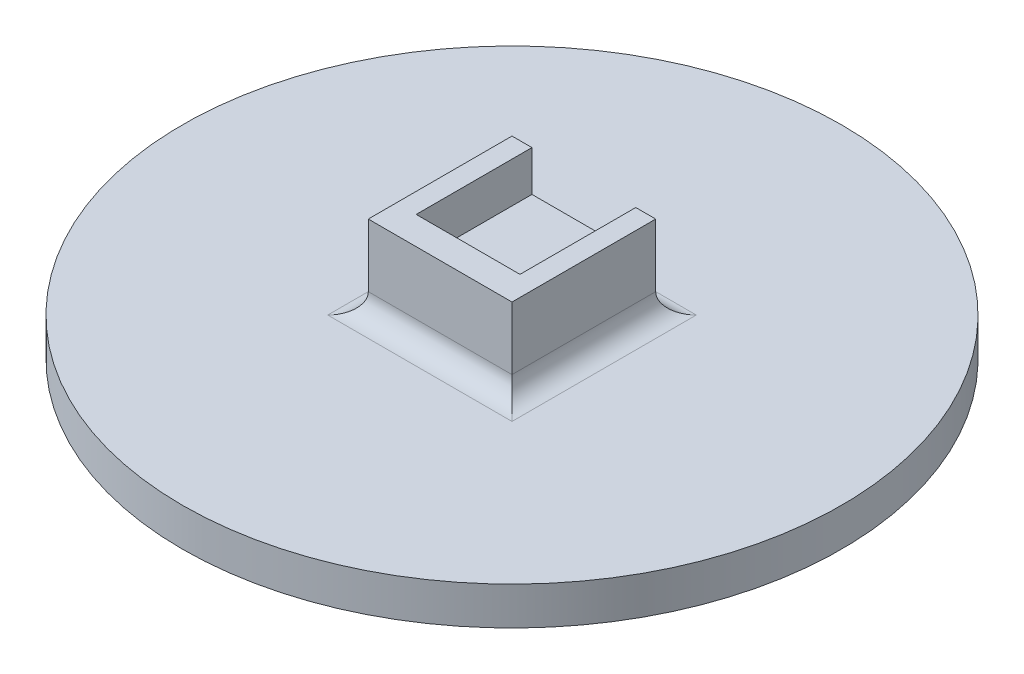
ISO-10303-21;
HEADER;
FILE_DESCRIPTION(('STEP AP214'),'2;1');
FILE_NAME('part.step','',(''),(''),'','','');
FILE_SCHEMA(('AUTOMOTIVE_DESIGN { 1 0 10303 214 1 1 1 1 }'));
ENDSEC;
DATA;
#1=APPLICATION_CONTEXT('core data for automotive mechanical design processes');
#2=APPLICATION_PROTOCOL_DEFINITION('international standard','automotive_design',2000,#1);
#3=PRODUCT_CONTEXT('',#1,'mechanical');
#4=PRODUCT('Part','Part','',(#3));
#5=PRODUCT_RELATED_PRODUCT_CATEGORY('part','',(#4));
#6=PRODUCT_DEFINITION_FORMATION('','',#4);
#7=PRODUCT_DEFINITION_CONTEXT('part definition',#1,'design');
#8=PRODUCT_DEFINITION('design','',#6,#7);
#9=PRODUCT_DEFINITION_SHAPE('','',#8);
#10=(LENGTH_UNIT() NAMED_UNIT(*) SI_UNIT(.MILLI.,.METRE.));
#11=(NAMED_UNIT(*) PLANE_ANGLE_UNIT() SI_UNIT($,.RADIAN.));
#12=(NAMED_UNIT(*) SI_UNIT($,.STERADIAN.) SOLID_ANGLE_UNIT());
#13=UNCERTAINTY_MEASURE_WITH_UNIT(LENGTH_MEASURE(1.E-05),#10,'distance_accuracy_value','');
#14=(GEOMETRIC_REPRESENTATION_CONTEXT(3) GLOBAL_UNCERTAINTY_ASSIGNED_CONTEXT((#13)) GLOBAL_UNIT_ASSIGNED_CONTEXT((#10,
#11,#12)) REPRESENTATION_CONTEXT('',''));
#15=CARTESIAN_POINT('',(0.,0.,0.));
#16=DIRECTION('',(0.,0.,1.));
#17=DIRECTION('',(1.,0.,0.));
#18=AXIS2_PLACEMENT_3D('',#15,#16,#17);
#19=CARTESIAN_POINT('',(0.,10.0965,0.));
#20=DIRECTION('',(0.,-1.,0.));
#21=DIRECTION('',(0.,0.,-1.));
#22=AXIS2_PLACEMENT_3D('',#19,#20,#21);
#23=PLANE('',#22);
#24=DIRECTION('',(0.,0.,-1.));
#25=VECTOR('',#24,1.);
#26=CARTESIAN_POINT('',(-6.5,10.0965,-9.));
#27=LINE('',#26,#25);
#28=CARTESIAN_POINT('',(-6.5,10.0965,5.5));
#29=VERTEX_POINT('',#28);
#30=CARTESIAN_POINT('',(-6.5,10.0965,-9.));
#31=VERTEX_POINT('',#30);
#32=EDGE_CURVE('E51',#29,#31,#27,.T.);
#33=ORIENTED_EDGE('',*,*,#32,.F.);
#34=DIRECTION('',(-1.,0.,0.));
#35=VECTOR('',#34,1.);
#36=CARTESIAN_POINT('',(-6.5,10.0965,5.5));
#37=LINE('',#36,#35);
#38=CARTESIAN_POINT('',(6.5,10.0965,5.5));
#39=VERTEX_POINT('',#38);
#40=EDGE_CURVE('E136',#39,#29,#37,.T.);
#41=ORIENTED_EDGE('',*,*,#40,.F.);
#42=DIRECTION('',(0.,0.,1.));
#43=VECTOR('',#42,1.);
#44=CARTESIAN_POINT('',(6.5,10.0965,5.5));
#45=LINE('',#44,#43);
#46=CARTESIAN_POINT('',(6.5,10.0965,-9.));
#47=VERTEX_POINT('',#46);
#48=EDGE_CURVE('E150',#47,#39,#45,.T.);
#49=ORIENTED_EDGE('',*,*,#48,.F.);
#50=DIRECTION('',(-1.,0.,0.));
#51=VECTOR('',#50,1.);
#52=CARTESIAN_POINT('',(-9.,10.0965,-9.));
#53=LINE('',#52,#51);
#54=EDGE_CURVE('E56',#47,#31,#53,.T.);
#55=ORIENTED_EDGE('',*,*,#54,.T.);
#56=EDGE_LOOP('',(#33,#41,#49,#55));
#57=FACE_BOUND('',#56,.T.);
#58=ADVANCED_FACE('F34',(#57),#23,.F.);
#59=CARTESIAN_POINT('',(0.,4.7625,0.));
#60=DIRECTION('',(0.,-1.,0.));
#61=DIRECTION('',(0.,0.,-1.));
#62=AXIS2_PLACEMENT_3D('',#59,#60,#61);
#63=CYLINDRICAL_SURFACE('',#62,41.275);
#64=CARTESIAN_POINT('',(0.,4.7625,0.));
#65=DIRECTION('',(0.,1.,0.));
#66=DIRECTION('',(0.,0.,1.));
#67=AXIS2_PLACEMENT_3D('',#64,#65,#66);
#68=CIRCLE('',#67,41.275);
#69=CARTESIAN_POINT('',(0.,4.7625,41.275));
#70=VERTEX_POINT('',#69);
#71=EDGE_CURVE('E173',#70,#70,#68,.T.);
#72=ORIENTED_EDGE('',*,*,#71,.F.);
#73=EDGE_LOOP('',(#72));
#74=FACE_BOUND('',#73,.T.);
#75=CARTESIAN_POINT('',(0.,0.,0.));
#76=DIRECTION('',(0.,1.,0.));
#77=DIRECTION('',(0.,0.,1.));
#78=AXIS2_PLACEMENT_3D('',#75,#76,#77);
#79=CIRCLE('',#78,41.275);
#80=CARTESIAN_POINT('',(0.,0.,41.275));
#81=VERTEX_POINT('',#80);
#82=EDGE_CURVE('E172',#81,#81,#79,.T.);
#83=ORIENTED_EDGE('',*,*,#82,.T.);
#84=EDGE_LOOP('',(#83));
#85=FACE_BOUND('',#84,.T.);
#86=ADVANCED_FACE('F245',(#74,#85),#63,.T.);
#87=CARTESIAN_POINT('',(0.,4.7625,0.));
#88=DIRECTION('',(0.,1.,0.));
#89=DIRECTION('',(0.,0.,1.));
#90=AXIS2_PLACEMENT_3D('',#87,#88,#89);
#91=PLANE('',#90);
#92=DIRECTION('',(-1.,0.,0.));
#93=VECTOR('',#92,1.);
#94=CARTESIAN_POINT('',(0.,4.7625,-11.54));
#95=LINE('',#94,#93);
#96=CARTESIAN_POINT('',(-11.54,4.7625,-11.54));
#97=VERTEX_POINT('',#96);
#98=CARTESIAN_POINT('',(11.54,4.7625,-11.54));
#99=VERTEX_POINT('',#98);
#100=EDGE_CURVE('E185',#97,#99,#95,.F.);
#101=ORIENTED_EDGE('',*,*,#100,.T.);
#102=DIRECTION('',(0.,0.,-1.));
#103=VECTOR('',#102,1.);
#104=CARTESIAN_POINT('',(11.54,4.7625,0.));
#105=LINE('',#104,#103);
#106=CARTESIAN_POINT('',(11.54,4.7625,11.54));
#107=VERTEX_POINT('',#106);
#108=EDGE_CURVE('E187',#99,#107,#105,.F.);
#109=ORIENTED_EDGE('',*,*,#108,.T.);
#110=DIRECTION('',(1.,0.,0.));
#111=VECTOR('',#110,1.);
#112=CARTESIAN_POINT('',(0.,4.7625,11.54));
#113=LINE('',#112,#111);
#114=CARTESIAN_POINT('',(-11.54,4.7625,11.54));
#115=VERTEX_POINT('',#114);
#116=EDGE_CURVE('E181',#107,#115,#113,.F.);
#117=ORIENTED_EDGE('',*,*,#116,.T.);
#118=DIRECTION('',(0.,0.,1.));
#119=VECTOR('',#118,1.);
#120=CARTESIAN_POINT('',(-11.54,4.7625,0.));
#121=LINE('',#120,#119);
#122=EDGE_CURVE('E183',#115,#97,#121,.F.);
#123=ORIENTED_EDGE('',*,*,#122,.T.);
#124=EDGE_LOOP('',(#101,#109,#117,#123));
#125=FACE_BOUND('',#124,.T.);
#126=ORIENTED_EDGE('',*,*,#71,.T.);
#127=EDGE_LOOP('',(#126));
#128=FACE_BOUND('',#127,.T.);
#129=ADVANCED_FACE('F210',(#125,#128),#91,.T.);
#130=CARTESIAN_POINT('',(0.,0.,0.));
#131=DIRECTION('',(0.,1.,0.));
#132=DIRECTION('',(0.,0.,1.));
#133=AXIS2_PLACEMENT_3D('',#130,#131,#132);
#134=PLANE('',#133);
#135=ORIENTED_EDGE('',*,*,#82,.F.);
#136=EDGE_LOOP('',(#135));
#137=FACE_BOUND('',#136,.T.);
#138=ADVANCED_FACE('F262',(#137),#134,.F.);
#139=CARTESIAN_POINT('',(9.,10.0965,9.));
#140=DIRECTION('',(-1.,0.,0.));
#141=DIRECTION('',(0.,0.,1.));
#142=AXIS2_PLACEMENT_3D('',#139,#140,#141);
#143=PLANE('',#142);
#144=DIRECTION('',(0.,-1.,0.));
#145=VECTOR('',#144,1.);
#146=CARTESIAN_POINT('',(9.,10.0965,9.));
#147=LINE('',#146,#145);
#148=CARTESIAN_POINT('',(9.,15.1765,9.));
#149=VERTEX_POINT('',#148);
#150=CARTESIAN_POINT('',(9.,7.3025,9.));
#151=VERTEX_POINT('',#150);
#152=EDGE_CURVE('E120',#149,#151,#147,.T.);
#153=ORIENTED_EDGE('',*,*,#152,.T.);
#154=DIRECTION('',(0.,0.,-1.));
#155=VECTOR('',#154,1.);
#156=CARTESIAN_POINT('',(9.,7.3025,9.));
#157=LINE('',#156,#155);
#158=CARTESIAN_POINT('',(9.,7.3025,-9.));
#159=VERTEX_POINT('',#158);
#160=EDGE_CURVE('E176',#151,#159,#157,.T.);
#161=ORIENTED_EDGE('',*,*,#160,.T.);
#162=DIRECTION('',(0.,-1.,0.));
#163=VECTOR('',#162,1.);
#164=CARTESIAN_POINT('',(9.,10.0965,-9.));
#165=LINE('',#164,#163);
#166=CARTESIAN_POINT('',(9.,15.1765,-9.));
#167=VERTEX_POINT('',#166);
#168=EDGE_CURVE('E169',#167,#159,#165,.T.);
#169=ORIENTED_EDGE('',*,*,#168,.F.);
#170=DIRECTION('',(0.,0.,-1.));
#171=VECTOR('',#170,1.);
#172=CARTESIAN_POINT('',(9.,15.1765,9.));
#173=LINE('',#172,#171);
#174=EDGE_CURVE('E129',#149,#167,#173,.T.);
#175=ORIENTED_EDGE('',*,*,#174,.F.);
#176=EDGE_LOOP('',(#153,#161,#169,#175));
#177=FACE_BOUND('',#176,.T.);
#178=ADVANCED_FACE('F220',(#177),#143,.F.);
#179=CARTESIAN_POINT('',(-9.,10.0965,-9.));
#180=DIRECTION('',(0.,0.,1.));
#181=DIRECTION('',(1.,0.,0.));
#182=AXIS2_PLACEMENT_3D('',#179,#180,#181);
#183=PLANE('',#182);
#184=ORIENTED_EDGE('',*,*,#168,.T.);
#185=DIRECTION('',(-1.,0.,0.));
#186=VECTOR('',#185,1.);
#187=CARTESIAN_POINT('',(-9.,7.3025,-9.));
#188=LINE('',#187,#186);
#189=CARTESIAN_POINT('',(-9.,7.3025,-9.));
#190=VERTEX_POINT('',#189);
#191=EDGE_CURVE('E190',#159,#190,#188,.T.);
#192=ORIENTED_EDGE('',*,*,#191,.T.);
#193=DIRECTION('',(0.,-1.,0.));
#194=VECTOR('',#193,1.);
#195=CARTESIAN_POINT('',(-9.,10.0965,-9.));
#196=LINE('',#195,#194);
#197=CARTESIAN_POINT('',(-9.,15.1765,-9.));
#198=VERTEX_POINT('',#197);
#199=EDGE_CURVE('E119',#198,#190,#196,.T.);
#200=ORIENTED_EDGE('',*,*,#199,.F.);
#201=DIRECTION('',(-1.,0.,0.));
#202=VECTOR('',#201,1.);
#203=CARTESIAN_POINT('',(-9.,15.1765,-9.));
#204=LINE('',#203,#202);
#205=CARTESIAN_POINT('',(-6.5,15.1765,-9.));
#206=VERTEX_POINT('',#205);
#207=EDGE_CURVE('E134',#206,#198,#204,.T.);
#208=ORIENTED_EDGE('',*,*,#207,.F.);
#209=DIRECTION('',(0.,-1.,0.));
#210=VECTOR('',#209,1.);
#211=CARTESIAN_POINT('',(-6.5,15.1765,-9.));
#212=LINE('',#211,#210);
#213=EDGE_CURVE('E149',#206,#31,#212,.T.);
#214=ORIENTED_EDGE('',*,*,#213,.T.);
#215=ORIENTED_EDGE('',*,*,#54,.F.);
#216=DIRECTION('',(0.,-1.,0.));
#217=VECTOR('',#216,1.);
#218=CARTESIAN_POINT('',(6.5,15.1765,-9.));
#219=LINE('',#218,#217);
#220=CARTESIAN_POINT('',(6.5,15.1765,-9.));
#221=VERTEX_POINT('',#220);
#222=EDGE_CURVE('E162',#221,#47,#219,.T.);
#223=ORIENTED_EDGE('',*,*,#222,.F.);
#224=DIRECTION('',(-1.,0.,0.));
#225=VECTOR('',#224,1.);
#226=CARTESIAN_POINT('',(6.5,15.1765,-9.));
#227=LINE('',#226,#225);
#228=EDGE_CURVE('E140',#167,#221,#227,.T.);
#229=ORIENTED_EDGE('',*,*,#228,.F.);
#230=EDGE_LOOP('',(#184,#192,#200,#208,#214,#215,#223,#229));
#231=FACE_BOUND('',#230,.T.);
#232=ADVANCED_FACE('F222',(#231),#183,.F.);
#233=CARTESIAN_POINT('',(-9.,10.0965,9.));
#234=DIRECTION('',(1.,0.,0.));
#235=DIRECTION('',(0.,0.,-1.));
#236=AXIS2_PLACEMENT_3D('',#233,#234,#235);
#237=PLANE('',#236);
#238=ORIENTED_EDGE('',*,*,#199,.T.);
#239=DIRECTION('',(0.,0.,1.));
#240=VECTOR('',#239,1.);
#241=CARTESIAN_POINT('',(-9.,7.3025,9.));
#242=LINE('',#241,#240);
#243=CARTESIAN_POINT('',(-9.,7.3025,9.));
#244=VERTEX_POINT('',#243);
#245=EDGE_CURVE('E43',#190,#244,#242,.T.);
#246=ORIENTED_EDGE('',*,*,#245,.T.);
#247=DIRECTION('',(0.,-1.,0.));
#248=VECTOR('',#247,1.);
#249=CARTESIAN_POINT('',(-9.,10.0965,9.));
#250=LINE('',#249,#248);
#251=CARTESIAN_POINT('',(-9.,15.1765,9.));
#252=VERTEX_POINT('',#251);
#253=EDGE_CURVE('E110',#252,#244,#250,.T.);
#254=ORIENTED_EDGE('',*,*,#253,.F.);
#255=DIRECTION('',(0.,0.,1.));
#256=VECTOR('',#255,1.);
#257=CARTESIAN_POINT('',(-9.,15.1765,9.));
#258=LINE('',#257,#256);
#259=EDGE_CURVE('E115',#198,#252,#258,.T.);
#260=ORIENTED_EDGE('',*,*,#259,.F.);
#261=EDGE_LOOP('',(#238,#246,#254,#260));
#262=FACE_BOUND('',#261,.T.);
#263=ADVANCED_FACE('F113',(#262),#237,.F.);
#264=CARTESIAN_POINT('',(-9.,10.0965,9.));
#265=DIRECTION('',(0.,0.,-1.));
#266=DIRECTION('',(-1.,0.,0.));
#267=AXIS2_PLACEMENT_3D('',#264,#265,#266);
#268=PLANE('',#267);
#269=ORIENTED_EDGE('',*,*,#253,.T.);
#270=DIRECTION('',(1.,0.,0.));
#271=VECTOR('',#270,1.);
#272=CARTESIAN_POINT('',(-9.,7.3025,9.));
#273=LINE('',#272,#271);
#274=EDGE_CURVE('E11',#244,#151,#273,.T.);
#275=ORIENTED_EDGE('',*,*,#274,.T.);
#276=ORIENTED_EDGE('',*,*,#152,.F.);
#277=DIRECTION('',(1.,0.,0.));
#278=VECTOR('',#277,1.);
#279=CARTESIAN_POINT('',(-9.,15.1765,9.));
#280=LINE('',#279,#278);
#281=EDGE_CURVE('E123',#252,#149,#280,.T.);
#282=ORIENTED_EDGE('',*,*,#281,.F.);
#283=EDGE_LOOP('',(#269,#275,#276,#282));
#284=FACE_BOUND('',#283,.T.);
#285=ADVANCED_FACE('F124',(#284),#268,.F.);
#286=CARTESIAN_POINT('',(-11.54,7.3025,9.));
#287=DIRECTION('',(0.,0.,1.));
#288=DIRECTION('',(1.,0.,0.));
#289=AXIS2_PLACEMENT_3D('',#286,#287,#288);
#290=CYLINDRICAL_SURFACE('',#289,2.54);
#291=CARTESIAN_POINT('',(-11.54,7.3025,-11.54));
#292=DIRECTION('',(-0.707106781186547,0.,0.707106781186547));
#293=DIRECTION('',(0.707106781186547,0.,0.707106781186547));
#294=AXIS2_PLACEMENT_3D('',#291,#292,#293);
#295=ELLIPSE('',#294,3.59210244842766,2.54);
#296=EDGE_CURVE('E195',#97,#190,#295,.T.);
#297=ORIENTED_EDGE('',*,*,#296,.F.);
#298=ORIENTED_EDGE('',*,*,#122,.F.);
#299=CARTESIAN_POINT('',(-11.54,7.3025,11.54));
#300=DIRECTION('',(0.707106781186547,0.,0.707106781186547));
#301=DIRECTION('',(0.707106781186547,0.,-0.707106781186547));
#302=AXIS2_PLACEMENT_3D('',#299,#300,#301);
#303=ELLIPSE('',#302,3.59210244842766,2.54);
#304=EDGE_CURVE('E38',#244,#115,#303,.F.);
#305=ORIENTED_EDGE('',*,*,#304,.F.);
#306=ORIENTED_EDGE('',*,*,#245,.F.);
#307=EDGE_LOOP('',(#297,#298,#305,#306));
#308=FACE_BOUND('',#307,.T.);
#309=ADVANCED_FACE('F36',(#308),#290,.F.);
#310=CARTESIAN_POINT('',(-9.,7.3025,11.54));
#311=DIRECTION('',(1.,0.,0.));
#312=DIRECTION('',(0.,0.,-1.));
#313=AXIS2_PLACEMENT_3D('',#310,#311,#312);
#314=CYLINDRICAL_SURFACE('',#313,2.54);
#315=ORIENTED_EDGE('',*,*,#304,.T.);
#316=ORIENTED_EDGE('',*,*,#116,.F.);
#317=CARTESIAN_POINT('',(11.54,7.3025,11.54));
#318=DIRECTION('',(0.707106781186547,0.,-0.707106781186547));
#319=DIRECTION('',(0.707106781186547,0.,0.707106781186547));
#320=AXIS2_PLACEMENT_3D('',#317,#318,#319);
#321=ELLIPSE('',#320,3.59210244842766,2.54);
#322=EDGE_CURVE('E194',#151,#107,#321,.F.);
#323=ORIENTED_EDGE('',*,*,#322,.F.);
#324=ORIENTED_EDGE('',*,*,#274,.F.);
#325=EDGE_LOOP('',(#315,#316,#323,#324));
#326=FACE_BOUND('',#325,.T.);
#327=ADVANCED_FACE('F205',(#326),#314,.F.);
#328=CARTESIAN_POINT('',(-9.,7.3025,-11.54));
#329=DIRECTION('',(-1.,0.,0.));
#330=DIRECTION('',(0.,0.,1.));
#331=AXIS2_PLACEMENT_3D('',#328,#329,#330);
#332=CYLINDRICAL_SURFACE('',#331,2.54);
#333=ORIENTED_EDGE('',*,*,#296,.T.);
#334=ORIENTED_EDGE('',*,*,#191,.F.);
#335=CARTESIAN_POINT('',(11.54,7.3025,-11.54));
#336=DIRECTION('',(-0.707106781186547,0.,-0.707106781186547));
#337=DIRECTION('',(-0.707106781186547,0.,0.707106781186547));
#338=AXIS2_PLACEMENT_3D('',#335,#336,#337);
#339=ELLIPSE('',#338,3.59210244842766,2.54);
#340=EDGE_CURVE('E165',#99,#159,#339,.T.);
#341=ORIENTED_EDGE('',*,*,#340,.F.);
#342=ORIENTED_EDGE('',*,*,#100,.F.);
#343=EDGE_LOOP('',(#333,#334,#341,#342));
#344=FACE_BOUND('',#343,.T.);
#345=ADVANCED_FACE('F217',(#344),#332,.F.);
#346=CARTESIAN_POINT('',(11.54,7.3025,9.));
#347=DIRECTION('',(0.,0.,-1.));
#348=DIRECTION('',(-1.,0.,0.));
#349=AXIS2_PLACEMENT_3D('',#346,#347,#348);
#350=CYLINDRICAL_SURFACE('',#349,2.54);
#351=ORIENTED_EDGE('',*,*,#322,.T.);
#352=ORIENTED_EDGE('',*,*,#108,.F.);
#353=ORIENTED_EDGE('',*,*,#340,.T.);
#354=ORIENTED_EDGE('',*,*,#160,.F.);
#355=EDGE_LOOP('',(#351,#352,#353,#354));
#356=FACE_BOUND('',#355,.T.);
#357=ADVANCED_FACE('F215',(#356),#350,.F.);
#358=CARTESIAN_POINT('',(6.5,15.1765,5.5));
#359=DIRECTION('',(1.,0.,0.));
#360=DIRECTION('',(0.,0.,-1.));
#361=AXIS2_PLACEMENT_3D('',#358,#359,#360);
#362=PLANE('',#361);
#363=ORIENTED_EDGE('',*,*,#48,.T.);
#364=DIRECTION('',(0.,-1.,0.));
#365=VECTOR('',#364,1.);
#366=CARTESIAN_POINT('',(6.5,15.1765,5.5));
#367=LINE('',#366,#365);
#368=CARTESIAN_POINT('',(6.5,15.1765,5.5));
#369=VERTEX_POINT('',#368);
#370=EDGE_CURVE('E159',#369,#39,#367,.T.);
#371=ORIENTED_EDGE('',*,*,#370,.F.);
#372=DIRECTION('',(0.,0.,1.));
#373=VECTOR('',#372,1.);
#374=CARTESIAN_POINT('',(6.5,15.1765,5.5));
#375=LINE('',#374,#373);
#376=EDGE_CURVE('E142',#221,#369,#375,.T.);
#377=ORIENTED_EDGE('',*,*,#376,.F.);
#378=ORIENTED_EDGE('',*,*,#222,.T.);
#379=EDGE_LOOP('',(#363,#371,#377,#378));
#380=FACE_BOUND('',#379,.T.);
#381=ADVANCED_FACE('F229',(#380),#362,.F.);
#382=CARTESIAN_POINT('',(-6.5,15.1765,5.5));
#383=DIRECTION('',(0.,0.,1.));
#384=DIRECTION('',(1.,0.,0.));
#385=AXIS2_PLACEMENT_3D('',#382,#383,#384);
#386=PLANE('',#385);
#387=ORIENTED_EDGE('',*,*,#40,.T.);
#388=DIRECTION('',(0.,-1.,0.));
#389=VECTOR('',#388,1.);
#390=CARTESIAN_POINT('',(-6.5,15.1765,5.5));
#391=LINE('',#390,#389);
#392=CARTESIAN_POINT('',(-6.5,15.1765,5.5));
#393=VERTEX_POINT('',#392);
#394=EDGE_CURVE('E156',#393,#29,#391,.T.);
#395=ORIENTED_EDGE('',*,*,#394,.F.);
#396=DIRECTION('',(-1.,0.,0.));
#397=VECTOR('',#396,1.);
#398=CARTESIAN_POINT('',(-6.5,15.1765,5.5));
#399=LINE('',#398,#397);
#400=EDGE_CURVE('E144',#369,#393,#399,.T.);
#401=ORIENTED_EDGE('',*,*,#400,.F.);
#402=ORIENTED_EDGE('',*,*,#370,.T.);
#403=EDGE_LOOP('',(#387,#395,#401,#402));
#404=FACE_BOUND('',#403,.T.);
#405=ADVANCED_FACE('F231',(#404),#386,.F.);
#406=CARTESIAN_POINT('',(-6.5,15.1765,-9.));
#407=DIRECTION('',(-1.,0.,0.));
#408=DIRECTION('',(0.,0.,1.));
#409=AXIS2_PLACEMENT_3D('',#406,#407,#408);
#410=PLANE('',#409);
#411=ORIENTED_EDGE('',*,*,#32,.T.);
#412=ORIENTED_EDGE('',*,*,#213,.F.);
#413=DIRECTION('',(0.,0.,-1.));
#414=VECTOR('',#413,1.);
#415=CARTESIAN_POINT('',(-6.5,15.1765,-9.));
#416=LINE('',#415,#414);
#417=EDGE_CURVE('E146',#393,#206,#416,.T.);
#418=ORIENTED_EDGE('',*,*,#417,.F.);
#419=ORIENTED_EDGE('',*,*,#394,.T.);
#420=EDGE_LOOP('',(#411,#412,#418,#419));
#421=FACE_BOUND('',#420,.T.);
#422=ADVANCED_FACE('F235',(#421),#410,.F.);
#423=CARTESIAN_POINT('',(0.,15.1765,0.));
#424=DIRECTION('',(0.,-1.,0.));
#425=DIRECTION('',(0.,0.,-1.));
#426=AXIS2_PLACEMENT_3D('',#423,#424,#425);
#427=PLANE('',#426);
#428=ORIENTED_EDGE('',*,*,#259,.T.);
#429=ORIENTED_EDGE('',*,*,#281,.T.);
#430=ORIENTED_EDGE('',*,*,#174,.T.);
#431=ORIENTED_EDGE('',*,*,#228,.T.);
#432=ORIENTED_EDGE('',*,*,#376,.T.);
#433=ORIENTED_EDGE('',*,*,#400,.T.);
#434=ORIENTED_EDGE('',*,*,#417,.T.);
#435=ORIENTED_EDGE('',*,*,#207,.T.);
#436=EDGE_LOOP('',(#428,#429,#430,#431,#432,#433,#434,#435));
#437=FACE_BOUND('',#436,.T.);
#438=ADVANCED_FACE('F132',(#437),#427,.F.);
#439=CLOSED_SHELL('',(#58,#86,#129,#138,#178,#232,#263,#285,#309,#327,#345,#357,#381,#405,#422,#438));
#440=MANIFOLD_SOLID_BREP('B2',#439);
#441=ADVANCED_BREP_SHAPE_REPRESENTATION('',(#18,#440),#14);
#442=SHAPE_DEFINITION_REPRESENTATION(#9,#441);
ENDSEC;
END-ISO-10303-21;
